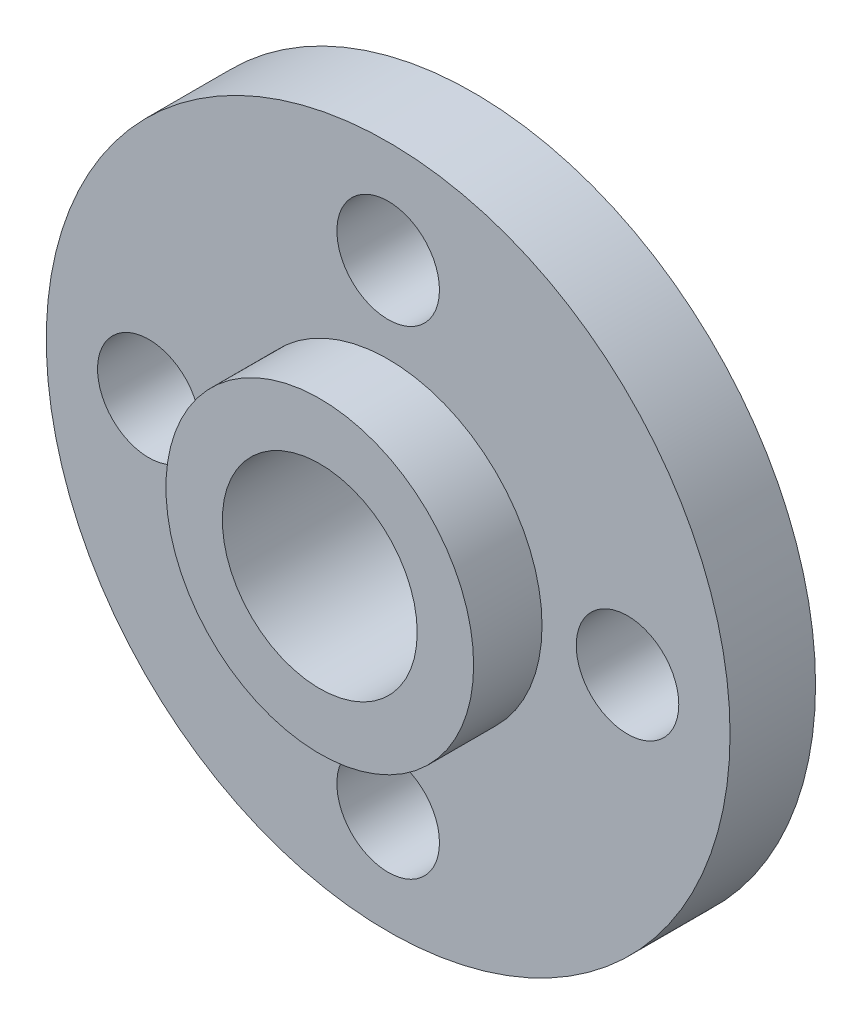
ISO-10303-21;
HEADER;
FILE_DESCRIPTION(('STEP AP214'),'2;1');
FILE_NAME('part.step','',(''),(''),'','','');
FILE_SCHEMA(('AUTOMOTIVE_DESIGN { 1 0 10303 214 1 1 1 1 }'));
ENDSEC;
DATA;
#1=APPLICATION_CONTEXT('core data for automotive mechanical design processes');
#2=APPLICATION_PROTOCOL_DEFINITION('international standard','automotive_design',2000,#1);
#3=PRODUCT_CONTEXT('',#1,'mechanical');
#4=PRODUCT('Part','Part','',(#3));
#5=PRODUCT_RELATED_PRODUCT_CATEGORY('part','',(#4));
#6=PRODUCT_DEFINITION_FORMATION('','',#4);
#7=PRODUCT_DEFINITION_CONTEXT('part definition',#1,'design');
#8=PRODUCT_DEFINITION('design','',#6,#7);
#9=PRODUCT_DEFINITION_SHAPE('','',#8);
#10=(LENGTH_UNIT() NAMED_UNIT(*) SI_UNIT(.MILLI.,.METRE.));
#11=(NAMED_UNIT(*) PLANE_ANGLE_UNIT() SI_UNIT($,.RADIAN.));
#12=(NAMED_UNIT(*) SI_UNIT($,.STERADIAN.) SOLID_ANGLE_UNIT());
#13=UNCERTAINTY_MEASURE_WITH_UNIT(LENGTH_MEASURE(1.E-05),#10,'distance_accuracy_value','');
#14=(GEOMETRIC_REPRESENTATION_CONTEXT(3) GLOBAL_UNCERTAINTY_ASSIGNED_CONTEXT((#13)) GLOBAL_UNIT_ASSIGNED_CONTEXT((#10,
#11,#12)) REPRESENTATION_CONTEXT('',''));
#15=CARTESIAN_POINT('',(0.,0.,0.));
#16=DIRECTION('',(0.,0.,1.));
#17=DIRECTION('',(1.,0.,0.));
#18=AXIS2_PLACEMENT_3D('',#15,#16,#17);
#19=CARTESIAN_POINT('',(0.,0.,2.5));
#20=DIRECTION('',(0.,0.,1.));
#21=DIRECTION('',(1.,0.,0.));
#22=AXIS2_PLACEMENT_3D('',#19,#20,#21);
#23=PLANE('',#22);
#24=CARTESIAN_POINT('',(0.,7.,2.5));
#25=DIRECTION('',(0.,0.,1.));
#26=DIRECTION('',(1.,0.,0.));
#27=AXIS2_PLACEMENT_3D('',#24,#25,#26);
#28=CIRCLE('',#27,1.5);
#29=CARTESIAN_POINT('',(1.5,7.,2.5));
#30=VERTEX_POINT('',#29);
#31=EDGE_CURVE('E73',#30,#30,#28,.T.);
#32=ORIENTED_EDGE('',*,*,#31,.F.);
#33=EDGE_LOOP('',(#32));
#34=FACE_BOUND('',#33,.T.);
#35=CARTESIAN_POINT('',(0.,-7.,2.5));
#36=DIRECTION('',(0.,0.,1.));
#37=DIRECTION('',(1.,0.,0.));
#38=AXIS2_PLACEMENT_3D('',#35,#36,#37);
#39=CIRCLE('',#38,1.5);
#40=CARTESIAN_POINT('',(1.5,-7.,2.5));
#41=VERTEX_POINT('',#40);
#42=EDGE_CURVE('E67',#41,#41,#39,.T.);
#43=ORIENTED_EDGE('',*,*,#42,.F.);
#44=EDGE_LOOP('',(#43));
#45=FACE_BOUND('',#44,.T.);
#46=CARTESIAN_POINT('',(7.,0.,2.5));
#47=DIRECTION('',(0.,0.,1.));
#48=DIRECTION('',(1.,0.,0.));
#49=AXIS2_PLACEMENT_3D('',#46,#47,#48);
#50=CIRCLE('',#49,1.5);
#51=CARTESIAN_POINT('',(8.5,0.,2.5));
#52=VERTEX_POINT('',#51);
#53=EDGE_CURVE('E61',#52,#52,#50,.T.);
#54=ORIENTED_EDGE('',*,*,#53,.F.);
#55=EDGE_LOOP('',(#54));
#56=FACE_BOUND('',#55,.T.);
#57=CARTESIAN_POINT('',(-7.,0.,2.5));
#58=DIRECTION('',(0.,0.,1.));
#59=DIRECTION('',(1.,0.,0.));
#60=AXIS2_PLACEMENT_3D('',#57,#58,#59);
#61=CIRCLE('',#60,1.5);
#62=CARTESIAN_POINT('',(-5.5,0.,2.5));
#63=VERTEX_POINT('',#62);
#64=EDGE_CURVE('E55',#63,#63,#61,.T.);
#65=ORIENTED_EDGE('',*,*,#64,.F.);
#66=EDGE_LOOP('',(#65));
#67=FACE_BOUND('',#66,.T.);
#68=CARTESIAN_POINT('',(0.,0.,2.5));
#69=DIRECTION('',(0.,0.,1.));
#70=DIRECTION('',(1.,0.,0.));
#71=AXIS2_PLACEMENT_3D('',#68,#69,#70);
#72=CIRCLE('',#71,10.);
#73=CARTESIAN_POINT('',(10.,0.,2.5));
#74=VERTEX_POINT('',#73);
#75=EDGE_CURVE('E10',#74,#74,#72,.T.);
#76=ORIENTED_EDGE('',*,*,#75,.T.);
#77=EDGE_LOOP('',(#76));
#78=FACE_BOUND('',#77,.T.);
#79=CARTESIAN_POINT('',(0.,0.,2.5));
#80=DIRECTION('',(0.,0.,1.));
#81=DIRECTION('',(1.,0.,0.));
#82=AXIS2_PLACEMENT_3D('',#79,#80,#81);
#83=CIRCLE('',#82,4.5);
#84=CARTESIAN_POINT('',(4.5,0.,2.5));
#85=VERTEX_POINT('',#84);
#86=EDGE_CURVE('E46',#85,#85,#83,.T.);
#87=ORIENTED_EDGE('',*,*,#86,.F.);
#88=EDGE_LOOP('',(#87));
#89=FACE_BOUND('',#88,.T.);
#90=ADVANCED_FACE('F30',(#34,#45,#56,#67,#78,#89),#23,.T.);
#91=CARTESIAN_POINT('',(0.,0.,0.));
#92=DIRECTION('',(0.,0.,1.));
#93=DIRECTION('',(1.,0.,0.));
#94=AXIS2_PLACEMENT_3D('',#91,#92,#93);
#95=PLANE('',#94);
#96=CARTESIAN_POINT('',(0.,7.,0.));
#97=DIRECTION('',(0.,0.,1.));
#98=DIRECTION('',(1.,0.,0.));
#99=AXIS2_PLACEMENT_3D('',#96,#97,#98);
#100=CIRCLE('',#99,1.5);
#101=CARTESIAN_POINT('',(1.5,7.,0.));
#102=VERTEX_POINT('',#101);
#103=EDGE_CURVE('E54',#102,#102,#100,.T.);
#104=ORIENTED_EDGE('',*,*,#103,.T.);
#105=EDGE_LOOP('',(#104));
#106=FACE_BOUND('',#105,.T.);
#107=CARTESIAN_POINT('',(0.,-7.,0.));
#108=DIRECTION('',(0.,0.,1.));
#109=DIRECTION('',(1.,0.,0.));
#110=AXIS2_PLACEMENT_3D('',#107,#108,#109);
#111=CIRCLE('',#110,1.5);
#112=CARTESIAN_POINT('',(1.5,-7.,0.));
#113=VERTEX_POINT('',#112);
#114=EDGE_CURVE('E70',#113,#113,#111,.T.);
#115=ORIENTED_EDGE('',*,*,#114,.T.);
#116=EDGE_LOOP('',(#115));
#117=FACE_BOUND('',#116,.T.);
#118=CARTESIAN_POINT('',(7.,0.,0.));
#119=DIRECTION('',(0.,0.,1.));
#120=DIRECTION('',(1.,0.,0.));
#121=AXIS2_PLACEMENT_3D('',#118,#119,#120);
#122=CIRCLE('',#121,1.5);
#123=CARTESIAN_POINT('',(8.5,0.,0.));
#124=VERTEX_POINT('',#123);
#125=EDGE_CURVE('E64',#124,#124,#122,.T.);
#126=ORIENTED_EDGE('',*,*,#125,.T.);
#127=EDGE_LOOP('',(#126));
#128=FACE_BOUND('',#127,.T.);
#129=CARTESIAN_POINT('',(-7.,0.,0.));
#130=DIRECTION('',(0.,0.,1.));
#131=DIRECTION('',(1.,0.,0.));
#132=AXIS2_PLACEMENT_3D('',#129,#130,#131);
#133=CIRCLE('',#132,1.5);
#134=CARTESIAN_POINT('',(-5.5,0.,0.));
#135=VERTEX_POINT('',#134);
#136=EDGE_CURVE('E58',#135,#135,#133,.T.);
#137=ORIENTED_EDGE('',*,*,#136,.T.);
#138=EDGE_LOOP('',(#137));
#139=FACE_BOUND('',#138,.T.);
#140=CARTESIAN_POINT('',(0.,0.,0.));
#141=DIRECTION('',(0.,0.,1.));
#142=DIRECTION('',(1.,0.,0.));
#143=AXIS2_PLACEMENT_3D('',#140,#141,#142);
#144=CIRCLE('',#143,10.);
#145=CARTESIAN_POINT('',(10.,0.,0.));
#146=VERTEX_POINT('',#145);
#147=EDGE_CURVE('E34',#146,#146,#144,.T.);
#148=ORIENTED_EDGE('',*,*,#147,.F.);
#149=EDGE_LOOP('',(#148));
#150=FACE_BOUND('',#149,.T.);
#151=CARTESIAN_POINT('',(0.,0.,0.));
#152=DIRECTION('',(0.,0.,1.));
#153=DIRECTION('',(1.,0.,0.));
#154=AXIS2_PLACEMENT_3D('',#151,#152,#153);
#155=CIRCLE('',#154,2.85);
#156=CARTESIAN_POINT('',(2.85,0.,0.));
#157=VERTEX_POINT('',#156);
#158=EDGE_CURVE('E41',#157,#157,#155,.T.);
#159=ORIENTED_EDGE('',*,*,#158,.T.);
#160=EDGE_LOOP('',(#159));
#161=FACE_BOUND('',#160,.T.);
#162=ADVANCED_FACE('F79',(#106,#117,#128,#139,#150,#161),#95,.F.);
#163=CARTESIAN_POINT('',(0.,0.,2.5));
#164=DIRECTION('',(0.,0.,-1.));
#165=DIRECTION('',(-1.,0.,0.));
#166=AXIS2_PLACEMENT_3D('',#163,#164,#165);
#167=CYLINDRICAL_SURFACE('',#166,10.);
#168=ORIENTED_EDGE('',*,*,#75,.F.);
#169=EDGE_LOOP('',(#168));
#170=FACE_BOUND('',#169,.T.);
#171=ORIENTED_EDGE('',*,*,#147,.T.);
#172=EDGE_LOOP('',(#171));
#173=FACE_BOUND('',#172,.T.);
#174=ADVANCED_FACE('F32',(#170,#173),#167,.T.);
#175=CARTESIAN_POINT('',(0.,0.,2.5));
#176=DIRECTION('',(0.,0.,-1.));
#177=DIRECTION('',(-1.,0.,0.));
#178=AXIS2_PLACEMENT_3D('',#175,#176,#177);
#179=CYLINDRICAL_SURFACE('',#178,2.85);
#180=ORIENTED_EDGE('',*,*,#158,.F.);
#181=EDGE_LOOP('',(#180));
#182=FACE_BOUND('',#181,.T.);
#183=CARTESIAN_POINT('',(0.,0.,4.5));
#184=DIRECTION('',(0.,0.,1.));
#185=DIRECTION('',(1.,0.,0.));
#186=AXIS2_PLACEMENT_3D('',#183,#184,#185);
#187=CIRCLE('',#186,2.85);
#188=CARTESIAN_POINT('',(2.85,0.,4.5));
#189=VERTEX_POINT('',#188);
#190=EDGE_CURVE('E49',#189,#189,#187,.T.);
#191=ORIENTED_EDGE('',*,*,#190,.T.);
#192=EDGE_LOOP('',(#191));
#193=FACE_BOUND('',#192,.T.);
#194=ADVANCED_FACE('F113',(#182,#193),#179,.F.);
#195=CARTESIAN_POINT('',(0.,0.,4.5));
#196=DIRECTION('',(0.,0.,1.));
#197=DIRECTION('',(1.,0.,0.));
#198=AXIS2_PLACEMENT_3D('',#195,#196,#197);
#199=PLANE('',#198);
#200=CARTESIAN_POINT('',(0.,0.,4.5));
#201=DIRECTION('',(0.,0.,1.));
#202=DIRECTION('',(1.,0.,0.));
#203=AXIS2_PLACEMENT_3D('',#200,#201,#202);
#204=CIRCLE('',#203,4.5);
#205=CARTESIAN_POINT('',(4.5,0.,4.5));
#206=VERTEX_POINT('',#205);
#207=EDGE_CURVE('E45',#206,#206,#204,.T.);
#208=ORIENTED_EDGE('',*,*,#207,.T.);
#209=EDGE_LOOP('',(#208));
#210=FACE_BOUND('',#209,.T.);
#211=ORIENTED_EDGE('',*,*,#190,.F.);
#212=EDGE_LOOP('',(#211));
#213=FACE_BOUND('',#212,.T.);
#214=ADVANCED_FACE('F103',(#210,#213),#199,.T.);
#215=CARTESIAN_POINT('',(0.,0.,4.5));
#216=DIRECTION('',(0.,0.,-1.));
#217=DIRECTION('',(-1.,0.,0.));
#218=AXIS2_PLACEMENT_3D('',#215,#216,#217);
#219=CYLINDRICAL_SURFACE('',#218,4.5);
#220=ORIENTED_EDGE('',*,*,#207,.F.);
#221=EDGE_LOOP('',(#220));
#222=FACE_BOUND('',#221,.T.);
#223=ORIENTED_EDGE('',*,*,#86,.T.);
#224=EDGE_LOOP('',(#223));
#225=FACE_BOUND('',#224,.T.);
#226=ADVANCED_FACE('F100',(#222,#225),#219,.T.);
#227=CARTESIAN_POINT('',(-7.,0.,0.));
#228=DIRECTION('',(0.,0.,1.));
#229=DIRECTION('',(1.,0.,0.));
#230=AXIS2_PLACEMENT_3D('',#227,#228,#229);
#231=CYLINDRICAL_SURFACE('',#230,1.5);
#232=ORIENTED_EDGE('',*,*,#136,.F.);
#233=EDGE_LOOP('',(#232));
#234=FACE_BOUND('',#233,.T.);
#235=ORIENTED_EDGE('',*,*,#64,.T.);
#236=EDGE_LOOP('',(#235));
#237=FACE_BOUND('',#236,.T.);
#238=ADVANCED_FACE('F102',(#234,#237),#231,.F.);
#239=CARTESIAN_POINT('',(7.,0.,0.));
#240=DIRECTION('',(0.,0.,1.));
#241=DIRECTION('',(1.,0.,0.));
#242=AXIS2_PLACEMENT_3D('',#239,#240,#241);
#243=CYLINDRICAL_SURFACE('',#242,1.5);
#244=ORIENTED_EDGE('',*,*,#125,.F.);
#245=EDGE_LOOP('',(#244));
#246=FACE_BOUND('',#245,.T.);
#247=ORIENTED_EDGE('',*,*,#53,.T.);
#248=EDGE_LOOP('',(#247));
#249=FACE_BOUND('',#248,.T.);
#250=ADVANCED_FACE('F110',(#246,#249),#243,.F.);
#251=CARTESIAN_POINT('',(0.,-7.,0.));
#252=DIRECTION('',(0.,0.,1.));
#253=DIRECTION('',(1.,0.,0.));
#254=AXIS2_PLACEMENT_3D('',#251,#252,#253);
#255=CYLINDRICAL_SURFACE('',#254,1.5);
#256=ORIENTED_EDGE('',*,*,#114,.F.);
#257=EDGE_LOOP('',(#256));
#258=FACE_BOUND('',#257,.T.);
#259=ORIENTED_EDGE('',*,*,#42,.T.);
#260=EDGE_LOOP('',(#259));
#261=FACE_BOUND('',#260,.T.);
#262=ADVANCED_FACE('F85',(#258,#261),#255,.F.);
#263=CARTESIAN_POINT('',(0.,7.,0.));
#264=DIRECTION('',(0.,0.,1.));
#265=DIRECTION('',(1.,0.,0.));
#266=AXIS2_PLACEMENT_3D('',#263,#264,#265);
#267=CYLINDRICAL_SURFACE('',#266,1.5);
#268=ORIENTED_EDGE('',*,*,#103,.F.);
#269=EDGE_LOOP('',(#268));
#270=FACE_BOUND('',#269,.T.);
#271=ORIENTED_EDGE('',*,*,#31,.T.);
#272=EDGE_LOOP('',(#271));
#273=FACE_BOUND('',#272,.T.);
#274=ADVANCED_FACE('F82',(#270,#273),#267,.F.);
#275=CLOSED_SHELL('',(#90,#162,#174,#194,#214,#226,#238,#250,#262,#274));
#276=MANIFOLD_SOLID_BREP('B2',#275);
#277=ADVANCED_BREP_SHAPE_REPRESENTATION('',(#18,#276),#14);
#278=SHAPE_DEFINITION_REPRESENTATION(#9,#277);
ENDSEC;
END-ISO-10303-21;
